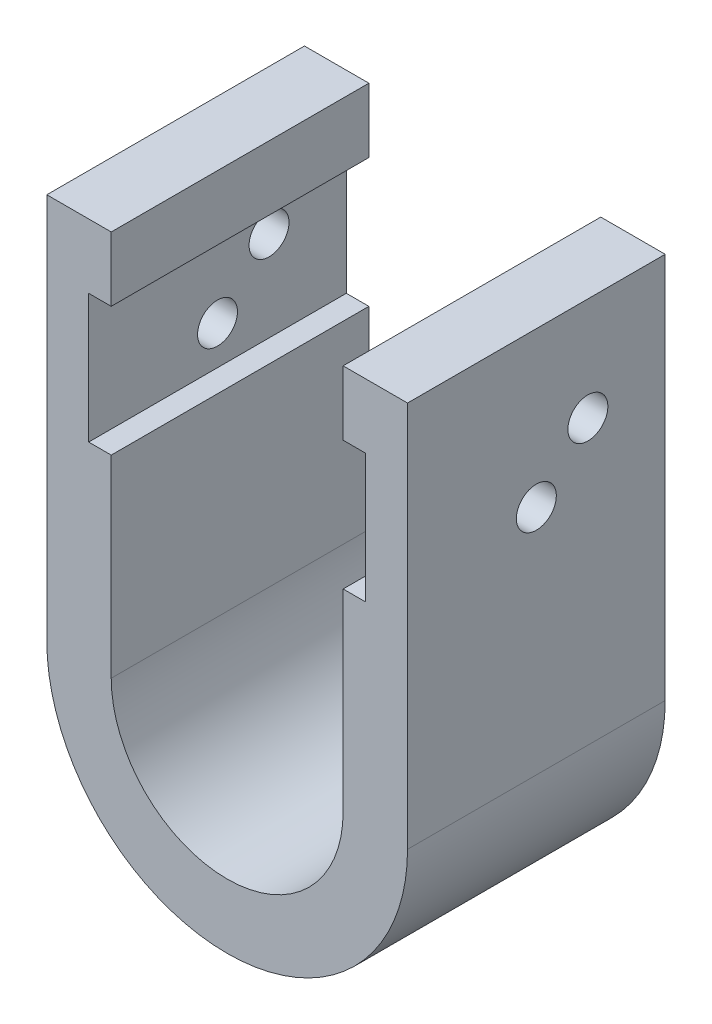
ISO-10303-21;
HEADER;
FILE_DESCRIPTION(('STEP AP214'),'2;1');
FILE_NAME('part.step','',(''),(''),'','','');
FILE_SCHEMA(('AUTOMOTIVE_DESIGN { 1 0 10303 214 1 1 1 1 }'));
ENDSEC;
DATA;
#1=APPLICATION_CONTEXT('core data for automotive mechanical design processes');
#2=APPLICATION_PROTOCOL_DEFINITION('international standard','automotive_design',2000,#1);
#3=PRODUCT_CONTEXT('',#1,'mechanical');
#4=PRODUCT('Part','Part','',(#3));
#5=PRODUCT_RELATED_PRODUCT_CATEGORY('part','',(#4));
#6=PRODUCT_DEFINITION_FORMATION('','',#4);
#7=PRODUCT_DEFINITION_CONTEXT('part definition',#1,'design');
#8=PRODUCT_DEFINITION('design','',#6,#7);
#9=PRODUCT_DEFINITION_SHAPE('','',#8);
#10=(LENGTH_UNIT() NAMED_UNIT(*) SI_UNIT(.MILLI.,.METRE.));
#11=(NAMED_UNIT(*) PLANE_ANGLE_UNIT() SI_UNIT($,.RADIAN.));
#12=(NAMED_UNIT(*) SI_UNIT($,.STERADIAN.) SOLID_ANGLE_UNIT());
#13=UNCERTAINTY_MEASURE_WITH_UNIT(LENGTH_MEASURE(1.E-05),#10,'distance_accuracy_value','');
#14=(GEOMETRIC_REPRESENTATION_CONTEXT(3) GLOBAL_UNCERTAINTY_ASSIGNED_CONTEXT((#13)) GLOBAL_UNIT_ASSIGNED_CONTEXT((#10,
#11,#12)) REPRESENTATION_CONTEXT('',''));
#15=CARTESIAN_POINT('',(0.,0.,0.));
#16=DIRECTION('',(0.,0.,1.));
#17=DIRECTION('',(1.,0.,0.));
#18=AXIS2_PLACEMENT_3D('',#15,#16,#17);
#19=CARTESIAN_POINT('',(-9.,0.,20.));
#20=DIRECTION('',(-1.,0.,0.));
#21=DIRECTION('',(0.,0.,1.));
#22=AXIS2_PLACEMENT_3D('',#19,#20,#21);
#23=PLANE('',#22);
#24=DIRECTION('',(0.,0.,-1.));
#25=VECTOR('',#24,1.);
#26=CARTESIAN_POINT('',(-9.,25.,20.001));
#27=LINE('',#26,#25);
#28=CARTESIAN_POINT('',(-9.,25.,20.));
#29=VERTEX_POINT('',#28);
#30=CARTESIAN_POINT('',(-9.,25.,0.));
#31=VERTEX_POINT('',#30);
#32=EDGE_CURVE('E162',#29,#31,#27,.T.);
#33=ORIENTED_EDGE('',*,*,#32,.T.);
#34=DIRECTION('',(0.,1.,0.));
#35=VECTOR('',#34,1.);
#36=CARTESIAN_POINT('',(-9.,0.,0.));
#37=LINE('',#36,#35);
#38=CARTESIAN_POINT('',(-9.,30.,0.));
#39=VERTEX_POINT('',#38);
#40=EDGE_CURVE('E209',#31,#39,#37,.T.);
#41=ORIENTED_EDGE('',*,*,#40,.T.);
#42=DIRECTION('',(0.,0.,-1.));
#43=VECTOR('',#42,1.);
#44=CARTESIAN_POINT('',(-9.,30.,20.));
#45=LINE('',#44,#43);
#46=CARTESIAN_POINT('',(-9.,30.,20.));
#47=VERTEX_POINT('',#46);
#48=EDGE_CURVE('E48',#47,#39,#45,.T.);
#49=ORIENTED_EDGE('',*,*,#48,.F.);
#50=DIRECTION('',(0.,1.,0.));
#51=VECTOR('',#50,1.);
#52=CARTESIAN_POINT('',(-9.,0.,20.));
#53=LINE('',#52,#51);
#54=EDGE_CURVE('E179',#29,#47,#53,.T.);
#55=ORIENTED_EDGE('',*,*,#54,.F.);
#56=EDGE_LOOP('',(#33,#41,#49,#55));
#57=FACE_BOUND('',#56,.T.);
#58=ADVANCED_FACE('F39',(#57),#23,.F.);
#59=DIRECTION('',(0.,0.,-1.));
#60=VECTOR('',#59,1.);
#61=CARTESIAN_POINT('',(-9.,15.,20.001));
#62=LINE('',#61,#60);
#63=CARTESIAN_POINT('',(-9.,15.,20.));
#64=VERTEX_POINT('',#63);
#65=CARTESIAN_POINT('',(-9.,15.,0.));
#66=VERTEX_POINT('',#65);
#67=EDGE_CURVE('E55',#64,#66,#62,.T.);
#68=ORIENTED_EDGE('',*,*,#67,.F.);
#69=CARTESIAN_POINT('',(-9.,0.,20.));
#70=VERTEX_POINT('',#69);
#71=EDGE_CURVE('E167',#70,#64,#53,.T.);
#72=ORIENTED_EDGE('',*,*,#71,.F.);
#73=DIRECTION('',(0.,0.,-1.));
#74=VECTOR('',#73,1.);
#75=CARTESIAN_POINT('',(-9.,0.,20.));
#76=LINE('',#75,#74);
#77=CARTESIAN_POINT('',(-9.,0.,0.));
#78=VERTEX_POINT('',#77);
#79=EDGE_CURVE('E11',#70,#78,#76,.T.);
#80=ORIENTED_EDGE('',*,*,#79,.T.);
#81=EDGE_CURVE('E169',#78,#66,#37,.T.);
#82=ORIENTED_EDGE('',*,*,#81,.T.);
#83=EDGE_LOOP('',(#68,#72,#80,#82));
#84=FACE_BOUND('',#83,.T.);
#85=ADVANCED_FACE('F166',(#84),#23,.F.);
#86=CARTESIAN_POINT('',(0.,0.,20.));
#87=DIRECTION('',(0.,0.,1.));
#88=DIRECTION('',(1.,0.,0.));
#89=AXIS2_PLACEMENT_3D('',#86,#87,#88);
#90=PLANE('',#89);
#91=DIRECTION('',(0.,-1.,0.));
#92=VECTOR('',#91,1.);
#93=CARTESIAN_POINT('',(-10.75,25.,20.));
#94=LINE('',#93,#92);
#95=CARTESIAN_POINT('',(-10.75,25.,20.));
#96=VERTEX_POINT('',#95);
#97=CARTESIAN_POINT('',(-10.75,15.,20.));
#98=VERTEX_POINT('',#97);
#99=EDGE_CURVE('E578',#96,#98,#94,.T.);
#100=ORIENTED_EDGE('',*,*,#99,.F.);
#101=DIRECTION('',(-1.,0.,0.));
#102=VECTOR('',#101,1.);
#103=CARTESIAN_POINT('',(-9.,25.,20.));
#104=LINE('',#103,#102);
#105=EDGE_CURVE('E284',#29,#96,#104,.T.);
#106=ORIENTED_EDGE('',*,*,#105,.F.);
#107=ORIENTED_EDGE('',*,*,#54,.T.);
#108=DIRECTION('',(-1.,0.,0.));
#109=VECTOR('',#108,1.);
#110=CARTESIAN_POINT('',(-14.,30.,20.));
#111=LINE('',#110,#109);
#112=CARTESIAN_POINT('',(-14.,30.,20.));
#113=VERTEX_POINT('',#112);
#114=EDGE_CURVE('E178',#47,#113,#111,.T.);
#115=ORIENTED_EDGE('',*,*,#114,.T.);
#116=DIRECTION('',(0.,-1.,0.));
#117=VECTOR('',#116,1.);
#118=CARTESIAN_POINT('',(-14.,0.,20.));
#119=LINE('',#118,#117);
#120=CARTESIAN_POINT('',(-14.,0.,20.));
#121=VERTEX_POINT('',#120);
#122=EDGE_CURVE('E183',#113,#121,#119,.T.);
#123=ORIENTED_EDGE('',*,*,#122,.T.);
#124=CARTESIAN_POINT('',(0.,0.,20.));
#125=DIRECTION('',(0.,0.,1.));
#126=DIRECTION('',(1.,0.,0.));
#127=AXIS2_PLACEMENT_3D('',#124,#125,#126);
#128=CIRCLE('',#127,14.);
#129=CARTESIAN_POINT('',(14.,0.,20.));
#130=VERTEX_POINT('',#129);
#131=EDGE_CURVE('E190',#121,#130,#128,.T.);
#132=ORIENTED_EDGE('',*,*,#131,.T.);
#133=DIRECTION('',(0.,1.,0.));
#134=VECTOR('',#133,1.);
#135=CARTESIAN_POINT('',(14.,30.,20.));
#136=LINE('',#135,#134);
#137=CARTESIAN_POINT('',(14.,30.,20.));
#138=VERTEX_POINT('',#137);
#139=EDGE_CURVE('E193',#130,#138,#136,.T.);
#140=ORIENTED_EDGE('',*,*,#139,.T.);
#141=DIRECTION('',(-1.,0.,0.));
#142=VECTOR('',#141,1.);
#143=CARTESIAN_POINT('',(9.,30.,20.));
#144=LINE('',#143,#142);
#145=CARTESIAN_POINT('',(9.,30.,20.));
#146=VERTEX_POINT('',#145);
#147=EDGE_CURVE('E196',#138,#146,#144,.T.);
#148=ORIENTED_EDGE('',*,*,#147,.T.);
#149=DIRECTION('',(0.,-1.,0.));
#150=VECTOR('',#149,1.);
#151=CARTESIAN_POINT('',(9.,30.,20.));
#152=LINE('',#151,#150);
#153=CARTESIAN_POINT('',(9.,25.,20.));
#154=VERTEX_POINT('',#153);
#155=EDGE_CURVE('E200',#146,#154,#152,.T.);
#156=ORIENTED_EDGE('',*,*,#155,.T.);
#157=DIRECTION('',(1.,0.,0.));
#158=VECTOR('',#157,1.);
#159=CARTESIAN_POINT('',(9.,25.,20.));
#160=LINE('',#159,#158);
#161=CARTESIAN_POINT('',(10.75,25.,20.));
#162=VERTEX_POINT('',#161);
#163=EDGE_CURVE('E327',#154,#162,#160,.T.);
#164=ORIENTED_EDGE('',*,*,#163,.T.);
#165=DIRECTION('',(0.,-1.,0.));
#166=VECTOR('',#165,1.);
#167=CARTESIAN_POINT('',(10.75,25.,20.));
#168=LINE('',#167,#166);
#169=CARTESIAN_POINT('',(10.75,15.,20.));
#170=VERTEX_POINT('',#169);
#171=EDGE_CURVE('E161',#162,#170,#168,.T.);
#172=ORIENTED_EDGE('',*,*,#171,.T.);
#173=DIRECTION('',(-1.,0.,0.));
#174=VECTOR('',#173,1.);
#175=CARTESIAN_POINT('',(10.75,15.,20.));
#176=LINE('',#175,#174);
#177=CARTESIAN_POINT('',(9.,15.,20.));
#178=VERTEX_POINT('',#177);
#179=EDGE_CURVE('E309',#170,#178,#176,.T.);
#180=ORIENTED_EDGE('',*,*,#179,.T.);
#181=CARTESIAN_POINT('',(9.,0.,20.));
#182=VERTEX_POINT('',#181);
#183=EDGE_CURVE('E199',#178,#182,#152,.T.);
#184=ORIENTED_EDGE('',*,*,#183,.T.);
#185=CARTESIAN_POINT('',(0.,0.,20.));
#186=DIRECTION('',(0.,0.,-1.));
#187=DIRECTION('',(1.,0.,0.));
#188=AXIS2_PLACEMENT_3D('',#185,#186,#187);
#189=CIRCLE('',#188,9.);
#190=EDGE_CURVE('E175',#182,#70,#189,.T.);
#191=ORIENTED_EDGE('',*,*,#190,.T.);
#192=ORIENTED_EDGE('',*,*,#71,.T.);
#193=DIRECTION('',(1.,0.,0.));
#194=VECTOR('',#193,1.);
#195=CARTESIAN_POINT('',(-10.75,15.,20.));
#196=LINE('',#195,#194);
#197=EDGE_CURVE('E153',#98,#64,#196,.T.);
#198=ORIENTED_EDGE('',*,*,#197,.F.);
#199=EDGE_LOOP('',(#100,#106,#107,#115,#123,#132,#140,#148,#156,#164,#172,#180,#184,#191,#192,#198));
#200=FACE_BOUND('',#199,.T.);
#201=ADVANCED_FACE('F173',(#200),#90,.T.);
#202=CARTESIAN_POINT('',(0.,0.,0.));
#203=DIRECTION('',(0.,0.,1.));
#204=DIRECTION('',(1.,0.,0.));
#205=AXIS2_PLACEMENT_3D('',#202,#203,#204);
#206=PLANE('',#205);
#207=DIRECTION('',(-1.,0.,0.));
#208=VECTOR('',#207,1.);
#209=CARTESIAN_POINT('',(-9.,25.,0.));
#210=LINE('',#209,#208);
#211=CARTESIAN_POINT('',(-10.75,25.,0.));
#212=VERTEX_POINT('',#211);
#213=EDGE_CURVE('E171',#31,#212,#210,.T.);
#214=ORIENTED_EDGE('',*,*,#213,.T.);
#215=DIRECTION('',(0.,-1.,0.));
#216=VECTOR('',#215,1.);
#217=CARTESIAN_POINT('',(-10.75,25.,0.));
#218=LINE('',#217,#216);
#219=CARTESIAN_POINT('',(-10.75,15.,0.));
#220=VERTEX_POINT('',#219);
#221=EDGE_CURVE('E571',#212,#220,#218,.T.);
#222=ORIENTED_EDGE('',*,*,#221,.T.);
#223=DIRECTION('',(1.,0.,0.));
#224=VECTOR('',#223,1.);
#225=CARTESIAN_POINT('',(-10.75,15.,0.));
#226=LINE('',#225,#224);
#227=EDGE_CURVE('E305',#220,#66,#226,.T.);
#228=ORIENTED_EDGE('',*,*,#227,.T.);
#229=ORIENTED_EDGE('',*,*,#81,.F.);
#230=CARTESIAN_POINT('',(0.,0.,0.));
#231=DIRECTION('',(0.,0.,-1.));
#232=DIRECTION('',(1.,0.,0.));
#233=AXIS2_PLACEMENT_3D('',#230,#231,#232);
#234=CIRCLE('',#233,9.);
#235=CARTESIAN_POINT('',(9.,0.,0.));
#236=VERTEX_POINT('',#235);
#237=EDGE_CURVE('E205',#236,#78,#234,.T.);
#238=ORIENTED_EDGE('',*,*,#237,.F.);
#239=DIRECTION('',(0.,-1.,0.));
#240=VECTOR('',#239,1.);
#241=CARTESIAN_POINT('',(9.,30.,0.));
#242=LINE('',#241,#240);
#243=CARTESIAN_POINT('',(9.,15.,0.));
#244=VERTEX_POINT('',#243);
#245=EDGE_CURVE('E228',#244,#236,#242,.T.);
#246=ORIENTED_EDGE('',*,*,#245,.F.);
#247=DIRECTION('',(-1.,0.,0.));
#248=VECTOR('',#247,1.);
#249=CARTESIAN_POINT('',(10.75,15.,0.));
#250=LINE('',#249,#248);
#251=CARTESIAN_POINT('',(10.75,15.,0.));
#252=VERTEX_POINT('',#251);
#253=EDGE_CURVE('E320',#252,#244,#250,.T.);
#254=ORIENTED_EDGE('',*,*,#253,.F.);
#255=DIRECTION('',(0.,-1.,0.));
#256=VECTOR('',#255,1.);
#257=CARTESIAN_POINT('',(10.75,25.,0.));
#258=LINE('',#257,#256);
#259=CARTESIAN_POINT('',(10.75,25.,0.));
#260=VERTEX_POINT('',#259);
#261=EDGE_CURVE('E316',#260,#252,#258,.T.);
#262=ORIENTED_EDGE('',*,*,#261,.F.);
#263=DIRECTION('',(1.,0.,0.));
#264=VECTOR('',#263,1.);
#265=CARTESIAN_POINT('',(9.,25.,0.));
#266=LINE('',#265,#264);
#267=CARTESIAN_POINT('',(9.,25.,0.));
#268=VERTEX_POINT('',#267);
#269=EDGE_CURVE('E313',#268,#260,#266,.T.);
#270=ORIENTED_EDGE('',*,*,#269,.F.);
#271=CARTESIAN_POINT('',(9.,30.,0.));
#272=VERTEX_POINT('',#271);
#273=EDGE_CURVE('E229',#272,#268,#242,.T.);
#274=ORIENTED_EDGE('',*,*,#273,.F.);
#275=DIRECTION('',(-1.,0.,0.));
#276=VECTOR('',#275,1.);
#277=CARTESIAN_POINT('',(9.,30.,0.));
#278=LINE('',#277,#276);
#279=CARTESIAN_POINT('',(14.,30.,0.));
#280=VERTEX_POINT('',#279);
#281=EDGE_CURVE('E225',#280,#272,#278,.T.);
#282=ORIENTED_EDGE('',*,*,#281,.F.);
#283=DIRECTION('',(0.,1.,0.));
#284=VECTOR('',#283,1.);
#285=CARTESIAN_POINT('',(14.,30.,0.));
#286=LINE('',#285,#284);
#287=CARTESIAN_POINT('',(14.,0.,0.));
#288=VERTEX_POINT('',#287);
#289=EDGE_CURVE('E222',#288,#280,#286,.T.);
#290=ORIENTED_EDGE('',*,*,#289,.F.);
#291=CARTESIAN_POINT('',(0.,0.,0.));
#292=DIRECTION('',(0.,0.,1.));
#293=DIRECTION('',(1.,0.,0.));
#294=AXIS2_PLACEMENT_3D('',#291,#292,#293);
#295=CIRCLE('',#294,14.);
#296=CARTESIAN_POINT('',(-14.,0.,0.));
#297=VERTEX_POINT('',#296);
#298=EDGE_CURVE('E219',#297,#288,#295,.T.);
#299=ORIENTED_EDGE('',*,*,#298,.F.);
#300=DIRECTION('',(0.,-1.,0.));
#301=VECTOR('',#300,1.);
#302=CARTESIAN_POINT('',(-14.,0.,0.));
#303=LINE('',#302,#301);
#304=CARTESIAN_POINT('',(-14.,30.,0.));
#305=VERTEX_POINT('',#304);
#306=EDGE_CURVE('E216',#305,#297,#303,.T.);
#307=ORIENTED_EDGE('',*,*,#306,.F.);
#308=DIRECTION('',(-1.,0.,0.));
#309=VECTOR('',#308,1.);
#310=CARTESIAN_POINT('',(-14.,30.,0.));
#311=LINE('',#310,#309);
#312=EDGE_CURVE('E213',#39,#305,#311,.T.);
#313=ORIENTED_EDGE('',*,*,#312,.F.);
#314=ORIENTED_EDGE('',*,*,#40,.F.);
#315=EDGE_LOOP('',(#214,#222,#228,#229,#238,#246,#254,#262,#270,#274,#282,#290,#299,#307,#313,#314));
#316=FACE_BOUND('',#315,.T.);
#317=ADVANCED_FACE('F269',(#316),#206,.F.);
#318=CARTESIAN_POINT('',(-16.,22.,6.));
#319=DIRECTION('',(1.,0.,0.));
#320=DIRECTION('',(0.,0.,-1.));
#321=AXIS2_PLACEMENT_3D('',#318,#319,#320);
#322=CYLINDRICAL_SURFACE('',#321,1.55);
#323=CARTESIAN_POINT('',(-14.,22.,6.));
#324=DIRECTION('',(1.,0.,0.));
#325=DIRECTION('',(0.,0.,-1.));
#326=AXIS2_PLACEMENT_3D('',#323,#324,#325);
#327=CIRCLE('',#326,1.55);
#328=CARTESIAN_POINT('',(-14.,22.,4.45));
#329=VERTEX_POINT('',#328);
#330=EDGE_CURVE('E352',#329,#329,#327,.T.);
#331=ORIENTED_EDGE('',*,*,#330,.F.);
#332=EDGE_LOOP('',(#331));
#333=FACE_BOUND('',#332,.T.);
#334=CARTESIAN_POINT('',(-10.75,22.,6.));
#335=DIRECTION('',(1.,0.,0.));
#336=DIRECTION('',(0.,1.,0.));
#337=AXIS2_PLACEMENT_3D('',#334,#335,#336);
#338=CIRCLE('',#337,1.55);
#339=CARTESIAN_POINT('',(-10.75,23.55,6.));
#340=VERTEX_POINT('',#339);
#341=EDGE_CURVE('E301',#340,#340,#338,.T.);
#342=ORIENTED_EDGE('',*,*,#341,.T.);
#343=EDGE_LOOP('',(#342));
#344=FACE_BOUND('',#343,.T.);
#345=ADVANCED_FACE('F368',(#333,#344),#322,.F.);
#346=CARTESIAN_POINT('',(-16.,18.,10.));
#347=DIRECTION('',(1.,0.,0.));
#348=DIRECTION('',(0.,0.,-1.));
#349=AXIS2_PLACEMENT_3D('',#346,#347,#348);
#350=CYLINDRICAL_SURFACE('',#349,1.55);
#351=CARTESIAN_POINT('',(-14.,18.,10.));
#352=DIRECTION('',(1.,0.,0.));
#353=DIRECTION('',(0.,0.,-1.));
#354=AXIS2_PLACEMENT_3D('',#351,#352,#353);
#355=CIRCLE('',#354,1.55);
#356=CARTESIAN_POINT('',(-14.,18.,8.45));
#357=VERTEX_POINT('',#356);
#358=EDGE_CURVE('E210',#357,#357,#355,.T.);
#359=ORIENTED_EDGE('',*,*,#358,.F.);
#360=EDGE_LOOP('',(#359));
#361=FACE_BOUND('',#360,.T.);
#362=CARTESIAN_POINT('',(-10.75,18.,10.));
#363=DIRECTION('',(1.,0.,0.));
#364=DIRECTION('',(0.,1.,0.));
#365=AXIS2_PLACEMENT_3D('',#362,#363,#364);
#366=CIRCLE('',#365,1.55);
#367=CARTESIAN_POINT('',(-10.75,19.55,10.));
#368=VERTEX_POINT('',#367);
#369=EDGE_CURVE('E297',#368,#368,#366,.T.);
#370=ORIENTED_EDGE('',*,*,#369,.T.);
#371=EDGE_LOOP('',(#370));
#372=FACE_BOUND('',#371,.T.);
#373=ADVANCED_FACE('F364',(#361,#372),#350,.F.);
#374=CARTESIAN_POINT('',(9.,30.,20.));
#375=DIRECTION('',(1.,0.,0.));
#376=DIRECTION('',(0.,0.,-1.));
#377=AXIS2_PLACEMENT_3D('',#374,#375,#376);
#378=PLANE('',#377);
#379=ORIENTED_EDGE('',*,*,#183,.F.);
#380=DIRECTION('',(0.,0.,-1.));
#381=VECTOR('',#380,1.);
#382=CARTESIAN_POINT('',(9.,15.,20.001));
#383=LINE('',#382,#381);
#384=EDGE_CURVE('E323',#178,#244,#383,.T.);
#385=ORIENTED_EDGE('',*,*,#384,.T.);
#386=ORIENTED_EDGE('',*,*,#245,.T.);
#387=DIRECTION('',(0.,0.,-1.));
#388=VECTOR('',#387,1.);
#389=CARTESIAN_POINT('',(9.,0.,20.));
#390=LINE('',#389,#388);
#391=EDGE_CURVE('E204',#182,#236,#390,.T.);
#392=ORIENTED_EDGE('',*,*,#391,.F.);
#393=EDGE_LOOP('',(#379,#385,#386,#392));
#394=FACE_BOUND('',#393,.T.);
#395=ADVANCED_FACE('F367',(#394),#378,.F.);
#396=CARTESIAN_POINT('',(0.,0.,20.));
#397=DIRECTION('',(0.,0.,-1.));
#398=DIRECTION('',(-1.,0.,0.));
#399=AXIS2_PLACEMENT_3D('',#396,#397,#398);
#400=CYLINDRICAL_SURFACE('',#399,9.);
#401=ORIENTED_EDGE('',*,*,#237,.T.);
#402=ORIENTED_EDGE('',*,*,#79,.F.);
#403=ORIENTED_EDGE('',*,*,#190,.F.);
#404=ORIENTED_EDGE('',*,*,#391,.T.);
#405=EDGE_LOOP('',(#401,#402,#403,#404));
#406=FACE_BOUND('',#405,.T.);
#407=ADVANCED_FACE('F41',(#406),#400,.F.);
#408=CARTESIAN_POINT('',(-14.,30.,20.));
#409=DIRECTION('',(0.,-1.,0.));
#410=DIRECTION('',(0.,0.,-1.));
#411=AXIS2_PLACEMENT_3D('',#408,#409,#410);
#412=PLANE('',#411);
#413=ORIENTED_EDGE('',*,*,#312,.T.);
#414=DIRECTION('',(0.,0.,-1.));
#415=VECTOR('',#414,1.);
#416=CARTESIAN_POINT('',(-14.,30.,20.));
#417=LINE('',#416,#415);
#418=EDGE_CURVE('E252',#113,#305,#417,.T.);
#419=ORIENTED_EDGE('',*,*,#418,.F.);
#420=ORIENTED_EDGE('',*,*,#114,.F.);
#421=ORIENTED_EDGE('',*,*,#48,.T.);
#422=EDGE_LOOP('',(#413,#419,#420,#421));
#423=FACE_BOUND('',#422,.T.);
#424=ADVANCED_FACE('F261',(#423),#412,.F.);
#425=CARTESIAN_POINT('',(-14.,0.,20.));
#426=DIRECTION('',(1.,0.,0.));
#427=DIRECTION('',(0.,0.,-1.));
#428=AXIS2_PLACEMENT_3D('',#425,#426,#427);
#429=PLANE('',#428);
#430=ORIENTED_EDGE('',*,*,#358,.T.);
#431=EDGE_LOOP('',(#430));
#432=FACE_BOUND('',#431,.T.);
#433=ORIENTED_EDGE('',*,*,#330,.T.);
#434=EDGE_LOOP('',(#433));
#435=FACE_BOUND('',#434,.T.);
#436=ORIENTED_EDGE('',*,*,#306,.T.);
#437=DIRECTION('',(0.,0.,-1.));
#438=VECTOR('',#437,1.);
#439=CARTESIAN_POINT('',(-14.,0.,20.));
#440=LINE('',#439,#438);
#441=EDGE_CURVE('E248',#121,#297,#440,.T.);
#442=ORIENTED_EDGE('',*,*,#441,.F.);
#443=ORIENTED_EDGE('',*,*,#122,.F.);
#444=ORIENTED_EDGE('',*,*,#418,.T.);
#445=EDGE_LOOP('',(#436,#442,#443,#444));
#446=FACE_BOUND('',#445,.T.);
#447=ADVANCED_FACE('F274',(#432,#435,#446),#429,.F.);
#448=CARTESIAN_POINT('',(0.,0.,20.));
#449=DIRECTION('',(0.,0.,-1.));
#450=DIRECTION('',(-1.,0.,0.));
#451=AXIS2_PLACEMENT_3D('',#448,#449,#450);
#452=CYLINDRICAL_SURFACE('',#451,14.);
#453=ORIENTED_EDGE('',*,*,#298,.T.);
#454=DIRECTION('',(0.,0.,-1.));
#455=VECTOR('',#454,1.);
#456=CARTESIAN_POINT('',(14.,0.,20.));
#457=LINE('',#456,#455);
#458=EDGE_CURVE('E244',#130,#288,#457,.T.);
#459=ORIENTED_EDGE('',*,*,#458,.F.);
#460=ORIENTED_EDGE('',*,*,#131,.F.);
#461=ORIENTED_EDGE('',*,*,#441,.T.);
#462=EDGE_LOOP('',(#453,#459,#460,#461));
#463=FACE_BOUND('',#462,.T.);
#464=ADVANCED_FACE('F278',(#463),#452,.T.);
#465=CARTESIAN_POINT('',(14.,30.,20.));
#466=DIRECTION('',(-1.,0.,0.));
#467=DIRECTION('',(0.,0.,1.));
#468=AXIS2_PLACEMENT_3D('',#465,#466,#467);
#469=PLANE('',#468);
#470=CARTESIAN_POINT('',(14.,18.,10.));
#471=DIRECTION('',(1.,0.,0.));
#472=DIRECTION('',(0.,0.,-1.));
#473=AXIS2_PLACEMENT_3D('',#470,#471,#472);
#474=CIRCLE('',#473,1.55);
#475=CARTESIAN_POINT('',(14.,18.,8.45));
#476=VERTEX_POINT('',#475);
#477=EDGE_CURVE('E348',#476,#476,#474,.T.);
#478=ORIENTED_EDGE('',*,*,#477,.F.);
#479=EDGE_LOOP('',(#478));
#480=FACE_BOUND('',#479,.T.);
#481=CARTESIAN_POINT('',(14.,22.,6.));
#482=DIRECTION('',(1.,0.,0.));
#483=DIRECTION('',(0.,0.,-1.));
#484=AXIS2_PLACEMENT_3D('',#481,#482,#483);
#485=CIRCLE('',#484,1.55);
#486=CARTESIAN_POINT('',(14.,22.,4.45));
#487=VERTEX_POINT('',#486);
#488=EDGE_CURVE('E347',#487,#487,#485,.T.);
#489=ORIENTED_EDGE('',*,*,#488,.F.);
#490=EDGE_LOOP('',(#489));
#491=FACE_BOUND('',#490,.T.);
#492=ORIENTED_EDGE('',*,*,#289,.T.);
#493=DIRECTION('',(0.,0.,-1.));
#494=VECTOR('',#493,1.);
#495=CARTESIAN_POINT('',(14.,30.,20.));
#496=LINE('',#495,#494);
#497=EDGE_CURVE('E240',#138,#280,#496,.T.);
#498=ORIENTED_EDGE('',*,*,#497,.F.);
#499=ORIENTED_EDGE('',*,*,#139,.F.);
#500=ORIENTED_EDGE('',*,*,#458,.T.);
#501=EDGE_LOOP('',(#492,#498,#499,#500));
#502=FACE_BOUND('',#501,.T.);
#503=ADVANCED_FACE('F406',(#480,#491,#502),#469,.F.);
#504=CARTESIAN_POINT('',(9.,30.,20.));
#505=DIRECTION('',(0.,-1.,0.));
#506=DIRECTION('',(0.,0.,-1.));
#507=AXIS2_PLACEMENT_3D('',#504,#505,#506);
#508=PLANE('',#507);
#509=ORIENTED_EDGE('',*,*,#281,.T.);
#510=DIRECTION('',(0.,0.,-1.));
#511=VECTOR('',#510,1.);
#512=CARTESIAN_POINT('',(9.,30.,20.));
#513=LINE('',#512,#511);
#514=EDGE_CURVE('E236',#146,#272,#513,.T.);
#515=ORIENTED_EDGE('',*,*,#514,.F.);
#516=ORIENTED_EDGE('',*,*,#147,.F.);
#517=ORIENTED_EDGE('',*,*,#497,.T.);
#518=EDGE_LOOP('',(#509,#515,#516,#517));
#519=FACE_BOUND('',#518,.T.);
#520=ADVANCED_FACE('F409',(#519),#508,.F.);
#521=ORIENTED_EDGE('',*,*,#273,.T.);
#522=DIRECTION('',(0.,0.,-1.));
#523=VECTOR('',#522,1.);
#524=CARTESIAN_POINT('',(9.,25.,20.001));
#525=LINE('',#524,#523);
#526=EDGE_CURVE('E63',#154,#268,#525,.T.);
#527=ORIENTED_EDGE('',*,*,#526,.F.);
#528=ORIENTED_EDGE('',*,*,#155,.F.);
#529=ORIENTED_EDGE('',*,*,#514,.T.);
#530=EDGE_LOOP('',(#521,#527,#528,#529));
#531=FACE_BOUND('',#530,.T.);
#532=ADVANCED_FACE('F393',(#531),#378,.F.);
#533=CARTESIAN_POINT('',(10.75,22.,6.));
#534=DIRECTION('',(1.,0.,0.));
#535=DIRECTION('',(0.,1.,0.));
#536=AXIS2_PLACEMENT_3D('',#533,#534,#535);
#537=CIRCLE('',#536,1.55);
#538=CARTESIAN_POINT('',(10.75,23.55,6.));
#539=VERTEX_POINT('',#538);
#540=EDGE_CURVE('E343',#539,#539,#537,.T.);
#541=ORIENTED_EDGE('',*,*,#540,.F.);
#542=EDGE_LOOP('',(#541));
#543=FACE_BOUND('',#542,.T.);
#544=ORIENTED_EDGE('',*,*,#488,.T.);
#545=EDGE_LOOP('',(#544));
#546=FACE_BOUND('',#545,.T.);
#547=ADVANCED_FACE('F385',(#543,#546),#322,.F.);
#548=CARTESIAN_POINT('',(10.75,18.,10.));
#549=DIRECTION('',(1.,0.,0.));
#550=DIRECTION('',(0.,1.,0.));
#551=AXIS2_PLACEMENT_3D('',#548,#549,#550);
#552=CIRCLE('',#551,1.55);
#553=CARTESIAN_POINT('',(10.75,19.55,10.));
#554=VERTEX_POINT('',#553);
#555=EDGE_CURVE('E339',#554,#554,#552,.T.);
#556=ORIENTED_EDGE('',*,*,#555,.F.);
#557=EDGE_LOOP('',(#556));
#558=FACE_BOUND('',#557,.T.);
#559=ORIENTED_EDGE('',*,*,#477,.T.);
#560=EDGE_LOOP('',(#559));
#561=FACE_BOUND('',#560,.T.);
#562=ADVANCED_FACE('F370',(#558,#561),#350,.F.);
#563=CARTESIAN_POINT('',(10.75,25.,20.001));
#564=DIRECTION('',(1.,0.,0.));
#565=DIRECTION('',(0.,1.,0.));
#566=AXIS2_PLACEMENT_3D('',#563,#564,#565);
#567=PLANE('',#566);
#568=ORIENTED_EDGE('',*,*,#540,.T.);
#569=EDGE_LOOP('',(#568));
#570=FACE_BOUND('',#569,.T.);
#571=ORIENTED_EDGE('',*,*,#555,.T.);
#572=EDGE_LOOP('',(#571));
#573=FACE_BOUND('',#572,.T.);
#574=DIRECTION('',(0.,0.,-1.));
#575=VECTOR('',#574,1.);
#576=CARTESIAN_POINT('',(10.75,25.,20.001));
#577=LINE('',#576,#575);
#578=EDGE_CURVE('E331',#162,#260,#577,.T.);
#579=ORIENTED_EDGE('',*,*,#578,.T.);
#580=ORIENTED_EDGE('',*,*,#261,.T.);
#581=DIRECTION('',(0.,0.,-1.));
#582=VECTOR('',#581,1.);
#583=CARTESIAN_POINT('',(10.75,15.,20.001));
#584=LINE('',#583,#582);
#585=EDGE_CURVE('E328',#170,#252,#584,.T.);
#586=ORIENTED_EDGE('',*,*,#585,.F.);
#587=ORIENTED_EDGE('',*,*,#171,.F.);
#588=EDGE_LOOP('',(#579,#580,#586,#587));
#589=FACE_BOUND('',#588,.T.);
#590=ADVANCED_FACE('F469',(#570,#573,#589),#567,.F.);
#591=CARTESIAN_POINT('',(10.75,15.,20.001));
#592=DIRECTION('',(0.,-1.,0.));
#593=DIRECTION('',(0.,0.,-1.));
#594=AXIS2_PLACEMENT_3D('',#591,#592,#593);
#595=PLANE('',#594);
#596=ORIENTED_EDGE('',*,*,#585,.T.);
#597=ORIENTED_EDGE('',*,*,#253,.T.);
#598=ORIENTED_EDGE('',*,*,#384,.F.);
#599=ORIENTED_EDGE('',*,*,#179,.F.);
#600=EDGE_LOOP('',(#596,#597,#598,#599));
#601=FACE_BOUND('',#600,.T.);
#602=ADVANCED_FACE('F466',(#601),#595,.F.);
#603=CARTESIAN_POINT('',(9.,25.,20.001));
#604=DIRECTION('',(0.,1.,0.));
#605=DIRECTION('',(0.,0.,1.));
#606=AXIS2_PLACEMENT_3D('',#603,#604,#605);
#607=PLANE('',#606);
#608=ORIENTED_EDGE('',*,*,#526,.T.);
#609=ORIENTED_EDGE('',*,*,#269,.T.);
#610=ORIENTED_EDGE('',*,*,#578,.F.);
#611=ORIENTED_EDGE('',*,*,#163,.F.);
#612=EDGE_LOOP('',(#608,#609,#610,#611));
#613=FACE_BOUND('',#612,.T.);
#614=ADVANCED_FACE('F377',(#613),#607,.F.);
#615=CARTESIAN_POINT('',(-10.75,25.,20.001));
#616=DIRECTION('',(1.,0.,0.));
#617=DIRECTION('',(0.,1.,0.));
#618=AXIS2_PLACEMENT_3D('',#615,#616,#617);
#619=PLANE('',#618);
#620=ORIENTED_EDGE('',*,*,#99,.T.);
#621=DIRECTION('',(0.,0.,-1.));
#622=VECTOR('',#621,1.);
#623=CARTESIAN_POINT('',(-10.75,15.,20.001));
#624=LINE('',#623,#622);
#625=EDGE_CURVE('E155',#98,#220,#624,.T.);
#626=ORIENTED_EDGE('',*,*,#625,.T.);
#627=ORIENTED_EDGE('',*,*,#221,.F.);
#628=DIRECTION('',(0.,0.,-1.));
#629=VECTOR('',#628,1.);
#630=CARTESIAN_POINT('',(-10.75,25.,20.001));
#631=LINE('',#630,#629);
#632=EDGE_CURVE('E288',#96,#212,#631,.T.);
#633=ORIENTED_EDGE('',*,*,#632,.F.);
#634=EDGE_LOOP('',(#620,#626,#627,#633));
#635=FACE_BOUND('',#634,.T.);
#636=ORIENTED_EDGE('',*,*,#369,.F.);
#637=EDGE_LOOP('',(#636));
#638=FACE_BOUND('',#637,.T.);
#639=ORIENTED_EDGE('',*,*,#341,.F.);
#640=EDGE_LOOP('',(#639));
#641=FACE_BOUND('',#640,.T.);
#642=ADVANCED_FACE('F373',(#635,#638,#641),#619,.T.);
#643=CARTESIAN_POINT('',(-9.,25.,20.001));
#644=DIRECTION('',(0.,-1.,0.));
#645=DIRECTION('',(0.,0.,-1.));
#646=AXIS2_PLACEMENT_3D('',#643,#644,#645);
#647=PLANE('',#646);
#648=ORIENTED_EDGE('',*,*,#105,.T.);
#649=ORIENTED_EDGE('',*,*,#632,.T.);
#650=ORIENTED_EDGE('',*,*,#213,.F.);
#651=ORIENTED_EDGE('',*,*,#32,.F.);
#652=EDGE_LOOP('',(#648,#649,#650,#651));
#653=FACE_BOUND('',#652,.T.);
#654=ADVANCED_FACE('F376',(#653),#647,.T.);
#655=CARTESIAN_POINT('',(-10.75,15.,20.001));
#656=DIRECTION('',(0.,1.,0.));
#657=DIRECTION('',(0.,0.,1.));
#658=AXIS2_PLACEMENT_3D('',#655,#656,#657);
#659=PLANE('',#658);
#660=ORIENTED_EDGE('',*,*,#197,.T.);
#661=ORIENTED_EDGE('',*,*,#67,.T.);
#662=ORIENTED_EDGE('',*,*,#227,.F.);
#663=ORIENTED_EDGE('',*,*,#625,.F.);
#664=EDGE_LOOP('',(#660,#661,#662,#663));
#665=FACE_BOUND('',#664,.T.);
#666=ADVANCED_FACE('F154',(#665),#659,.T.);
#667=CLOSED_SHELL('',(#58,#85,#201,#317,#345,#373,#395,#407,#424,#447,#464,#503,#520,#532,#547,
#562,#590,#602,#614,#642,#654,#666));
#668=MANIFOLD_SOLID_BREP('B2',#667);
#669=ADVANCED_BREP_SHAPE_REPRESENTATION('',(#18,#668),#14);
#670=SHAPE_DEFINITION_REPRESENTATION(#9,#669);
ENDSEC;
END-ISO-10303-21;
